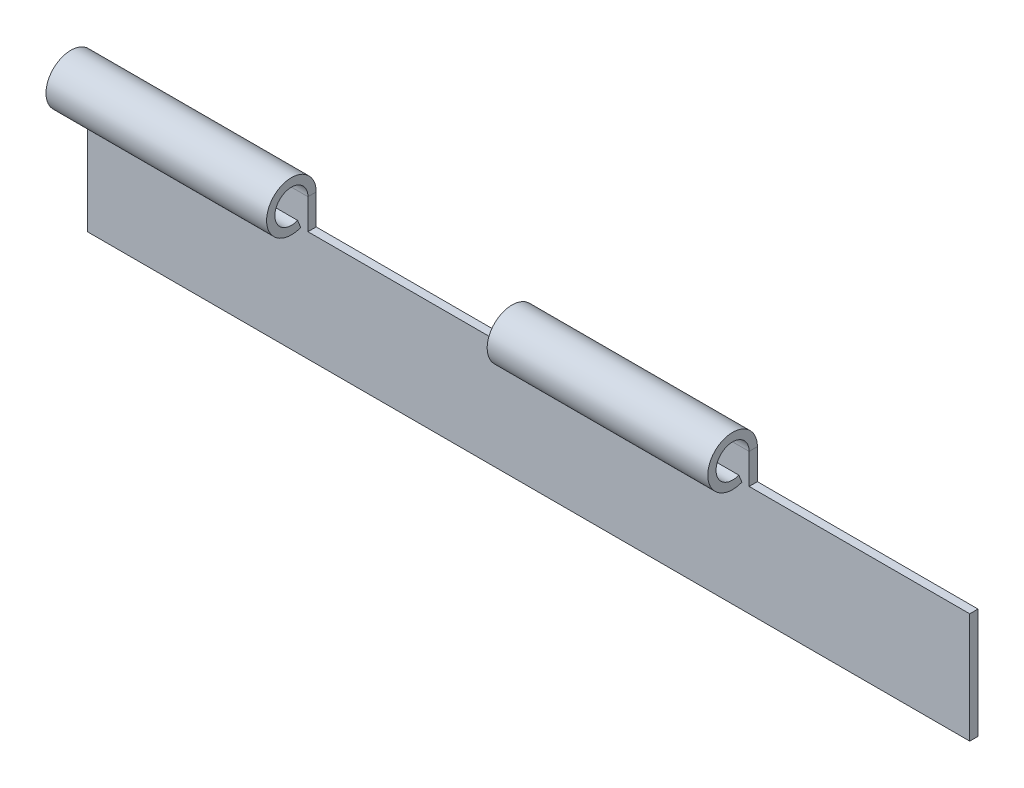
ISO-10303-21;
HEADER;
FILE_DESCRIPTION(('STEP AP214'),'2;1');
FILE_NAME('part.step','',(''),(''),'','','');
FILE_SCHEMA(('AUTOMOTIVE_DESIGN { 1 0 10303 214 1 1 1 1 }'));
ENDSEC;
DATA;
#1=APPLICATION_CONTEXT('core data for automotive mechanical design processes');
#2=APPLICATION_PROTOCOL_DEFINITION('international standard','automotive_design',2000,#1);
#3=PRODUCT_CONTEXT('',#1,'mechanical');
#4=PRODUCT('Part','Part','',(#3));
#5=PRODUCT_RELATED_PRODUCT_CATEGORY('part','',(#4));
#6=PRODUCT_DEFINITION_FORMATION('','',#4);
#7=PRODUCT_DEFINITION_CONTEXT('part definition',#1,'design');
#8=PRODUCT_DEFINITION('design','',#6,#7);
#9=PRODUCT_DEFINITION_SHAPE('','',#8);
#10=(LENGTH_UNIT() NAMED_UNIT(*) SI_UNIT(.MILLI.,.METRE.));
#11=(NAMED_UNIT(*) PLANE_ANGLE_UNIT() SI_UNIT($,.RADIAN.));
#12=(NAMED_UNIT(*) SI_UNIT($,.STERADIAN.) SOLID_ANGLE_UNIT());
#13=UNCERTAINTY_MEASURE_WITH_UNIT(LENGTH_MEASURE(1.E-05),#10,'distance_accuracy_value','');
#14=(GEOMETRIC_REPRESENTATION_CONTEXT(3) GLOBAL_UNCERTAINTY_ASSIGNED_CONTEXT((#13)) GLOBAL_UNIT_ASSIGNED_CONTEXT((#10,
#11,#12)) REPRESENTATION_CONTEXT('',''));
#15=CARTESIAN_POINT('',(0.,0.,0.));
#16=DIRECTION('',(0.,0.,1.));
#17=DIRECTION('',(1.,0.,0.));
#18=AXIS2_PLACEMENT_3D('',#15,#16,#17);
#19=CARTESIAN_POINT('',(80.,20.,-1.5));
#20=DIRECTION('',(-1.,0.,0.));
#21=DIRECTION('',(0.,0.,1.));
#22=AXIS2_PLACEMENT_3D('',#19,#20,#21);
#23=PLANE('',#22);
#24=DIRECTION('',(0.,-1.,0.));
#25=VECTOR('',#24,1.);
#26=CARTESIAN_POINT('',(80.,20.,0.));
#27=LINE('',#26,#25);
#28=CARTESIAN_POINT('',(80.,25.5,0.));
#29=VERTEX_POINT('',#28);
#30=CARTESIAN_POINT('',(80.,20.,0.));
#31=VERTEX_POINT('',#30);
#32=EDGE_CURVE('E250',#29,#31,#27,.T.);
#33=ORIENTED_EDGE('',*,*,#32,.F.);
#34=DIRECTION('',(0.,0.,-1.));
#35=VECTOR('',#34,1.);
#36=CARTESIAN_POINT('',(80.,25.5,0.));
#37=LINE('',#36,#35);
#38=CARTESIAN_POINT('',(80.,25.5,-1.5));
#39=VERTEX_POINT('',#38);
#40=EDGE_CURVE('E159',#29,#39,#37,.T.);
#41=ORIENTED_EDGE('',*,*,#40,.T.);
#42=DIRECTION('',(0.,-1.,0.));
#43=VECTOR('',#42,1.);
#44=CARTESIAN_POINT('',(80.,20.,-1.5));
#45=LINE('',#44,#43);
#46=CARTESIAN_POINT('',(80.,20.,-1.5));
#47=VERTEX_POINT('',#46);
#48=EDGE_CURVE('E169',#39,#47,#45,.T.);
#49=ORIENTED_EDGE('',*,*,#48,.T.);
#50=DIRECTION('',(0.,0.,1.));
#51=VECTOR('',#50,1.);
#52=CARTESIAN_POINT('',(80.,20.,-1.5));
#53=LINE('',#52,#51);
#54=EDGE_CURVE('E262',#47,#31,#53,.T.);
#55=ORIENTED_EDGE('',*,*,#54,.T.);
#56=EDGE_LOOP('',(#33,#41,#49,#55));
#57=FACE_BOUND('',#56,.T.);
#58=ADVANCED_FACE('F43',(#57),#23,.T.);
#59=CARTESIAN_POINT('',(0.,0.,-1.5));
#60=DIRECTION('',(-1.,0.,0.));
#61=DIRECTION('',(0.,0.,1.));
#62=AXIS2_PLACEMENT_3D('',#59,#60,#61);
#63=PLANE('',#62);
#64=DIRECTION('',(0.,-1.,0.));
#65=VECTOR('',#64,1.);
#66=CARTESIAN_POINT('',(0.,0.,0.));
#67=LINE('',#66,#65);
#68=CARTESIAN_POINT('',(0.,25.5,0.));
#69=VERTEX_POINT('',#68);
#70=CARTESIAN_POINT('',(0.,0.,0.));
#71=VERTEX_POINT('',#70);
#72=EDGE_CURVE('E229',#69,#71,#67,.T.);
#73=ORIENTED_EDGE('',*,*,#72,.F.);
#74=DIRECTION('',(0.,0.,-1.));
#75=VECTOR('',#74,1.);
#76=CARTESIAN_POINT('',(0.,25.5,0.));
#77=LINE('',#76,#75);
#78=CARTESIAN_POINT('',(0.,25.5,-1.5));
#79=VERTEX_POINT('',#78);
#80=EDGE_CURVE('E202',#69,#79,#77,.T.);
#81=ORIENTED_EDGE('',*,*,#80,.T.);
#82=DIRECTION('',(0.,-1.,0.));
#83=VECTOR('',#82,1.);
#84=CARTESIAN_POINT('',(0.,0.,-1.5));
#85=LINE('',#84,#83);
#86=CARTESIAN_POINT('',(0.,0.,-1.5));
#87=VERTEX_POINT('',#86);
#88=EDGE_CURVE('E238',#79,#87,#85,.T.);
#89=ORIENTED_EDGE('',*,*,#88,.T.);
#90=DIRECTION('',(0.,0.,1.));
#91=VECTOR('',#90,1.);
#92=CARTESIAN_POINT('',(0.,0.,-1.5));
#93=LINE('',#92,#91);
#94=EDGE_CURVE('E11',#87,#71,#93,.T.);
#95=ORIENTED_EDGE('',*,*,#94,.T.);
#96=EDGE_LOOP('',(#73,#81,#89,#95));
#97=FACE_BOUND('',#96,.T.);
#98=ADVANCED_FACE('F279',(#97),#63,.T.);
#99=CARTESIAN_POINT('',(160.,0.,-1.5));
#100=DIRECTION('',(0.,-1.,0.));
#101=DIRECTION('',(1.,0.,0.));
#102=AXIS2_PLACEMENT_3D('',#99,#100,#101);
#103=PLANE('',#102);
#104=DIRECTION('',(1.,0.,0.));
#105=VECTOR('',#104,1.);
#106=CARTESIAN_POINT('',(160.,0.,0.));
#107=LINE('',#106,#105);
#108=CARTESIAN_POINT('',(160.,0.,0.));
#109=VERTEX_POINT('',#108);
#110=EDGE_CURVE('E222',#71,#109,#107,.T.);
#111=ORIENTED_EDGE('',*,*,#110,.F.);
#112=ORIENTED_EDGE('',*,*,#94,.F.);
#113=DIRECTION('',(1.,0.,0.));
#114=VECTOR('',#113,1.);
#115=CARTESIAN_POINT('',(160.,0.,-1.5));
#116=LINE('',#115,#114);
#117=CARTESIAN_POINT('',(160.,0.,-1.5));
#118=VERTEX_POINT('',#117);
#119=EDGE_CURVE('E225',#87,#118,#116,.T.);
#120=ORIENTED_EDGE('',*,*,#119,.T.);
#121=DIRECTION('',(0.,0.,1.));
#122=VECTOR('',#121,1.);
#123=CARTESIAN_POINT('',(160.,0.,-1.5));
#124=LINE('',#123,#122);
#125=EDGE_CURVE('E47',#118,#109,#124,.T.);
#126=ORIENTED_EDGE('',*,*,#125,.T.);
#127=EDGE_LOOP('',(#111,#112,#120,#126));
#128=FACE_BOUND('',#127,.T.);
#129=ADVANCED_FACE('F45',(#128),#103,.T.);
#130=CARTESIAN_POINT('',(40.,30.,-1.5));
#131=DIRECTION('',(1.,0.,0.));
#132=DIRECTION('',(0.,0.,-1.));
#133=AXIS2_PLACEMENT_3D('',#130,#131,#132);
#134=PLANE('',#133);
#135=DIRECTION('',(0.,0.,-1.));
#136=VECTOR('',#135,1.);
#137=CARTESIAN_POINT('',(40.,25.5,0.));
#138=LINE('',#137,#136);
#139=CARTESIAN_POINT('',(40.,25.5,0.));
#140=VERTEX_POINT('',#139);
#141=CARTESIAN_POINT('',(40.,25.5,-1.5));
#142=VERTEX_POINT('',#141);
#143=EDGE_CURVE('E213',#140,#142,#138,.T.);
#144=ORIENTED_EDGE('',*,*,#143,.F.);
#145=DIRECTION('',(0.,1.,0.));
#146=VECTOR('',#145,1.);
#147=CARTESIAN_POINT('',(40.,30.,0.));
#148=LINE('',#147,#146);
#149=CARTESIAN_POINT('',(40.,20.,0.));
#150=VERTEX_POINT('',#149);
#151=EDGE_CURVE('E255',#150,#140,#148,.T.);
#152=ORIENTED_EDGE('',*,*,#151,.F.);
#153=DIRECTION('',(0.,0.,1.));
#154=VECTOR('',#153,1.);
#155=CARTESIAN_POINT('',(40.,20.,-1.5));
#156=LINE('',#155,#154);
#157=CARTESIAN_POINT('',(40.,20.,-1.5));
#158=VERTEX_POINT('',#157);
#159=EDGE_CURVE('E52',#158,#150,#156,.T.);
#160=ORIENTED_EDGE('',*,*,#159,.F.);
#161=DIRECTION('',(0.,1.,0.));
#162=VECTOR('',#161,1.);
#163=CARTESIAN_POINT('',(40.,30.,-1.5));
#164=LINE('',#163,#162);
#165=EDGE_CURVE('E235',#158,#142,#164,.T.);
#166=ORIENTED_EDGE('',*,*,#165,.T.);
#167=EDGE_LOOP('',(#144,#152,#160,#166));
#168=FACE_BOUND('',#167,.T.);
#169=ADVANCED_FACE('F309',(#168),#134,.T.);
#170=CARTESIAN_POINT('',(40.,20.,-1.5));
#171=DIRECTION('',(0.,1.,0.));
#172=DIRECTION('',(-1.,0.,0.));
#173=AXIS2_PLACEMENT_3D('',#170,#171,#172);
#174=PLANE('',#173);
#175=DIRECTION('',(-1.,0.,0.));
#176=VECTOR('',#175,1.);
#177=CARTESIAN_POINT('',(40.,20.,0.));
#178=LINE('',#177,#176);
#179=EDGE_CURVE('E253',#31,#150,#178,.T.);
#180=ORIENTED_EDGE('',*,*,#179,.F.);
#181=ORIENTED_EDGE('',*,*,#54,.F.);
#182=DIRECTION('',(-1.,0.,0.));
#183=VECTOR('',#182,1.);
#184=CARTESIAN_POINT('',(40.,20.,-1.5));
#185=LINE('',#184,#183);
#186=EDGE_CURVE('E233',#47,#158,#185,.T.);
#187=ORIENTED_EDGE('',*,*,#186,.T.);
#188=ORIENTED_EDGE('',*,*,#159,.T.);
#189=EDGE_LOOP('',(#180,#181,#187,#188));
#190=FACE_BOUND('',#189,.T.);
#191=ADVANCED_FACE('F303',(#190),#174,.T.);
#192=CARTESIAN_POINT('',(120.,30.,-1.5));
#193=DIRECTION('',(1.,0.,0.));
#194=DIRECTION('',(0.,0.,-1.));
#195=AXIS2_PLACEMENT_3D('',#192,#193,#194);
#196=PLANE('',#195);
#197=DIRECTION('',(0.,0.,-1.));
#198=VECTOR('',#197,1.);
#199=CARTESIAN_POINT('',(120.,25.5,0.));
#200=LINE('',#199,#198);
#201=CARTESIAN_POINT('',(120.,25.5,0.));
#202=VERTEX_POINT('',#201);
#203=CARTESIAN_POINT('',(120.,25.5,-1.5));
#204=VERTEX_POINT('',#203);
#205=EDGE_CURVE('E177',#202,#204,#200,.T.);
#206=ORIENTED_EDGE('',*,*,#205,.F.);
#207=DIRECTION('',(0.,1.,0.));
#208=VECTOR('',#207,1.);
#209=CARTESIAN_POINT('',(120.,30.,0.));
#210=LINE('',#209,#208);
#211=CARTESIAN_POINT('',(120.,20.,0.));
#212=VERTEX_POINT('',#211);
#213=EDGE_CURVE('E247',#212,#202,#210,.T.);
#214=ORIENTED_EDGE('',*,*,#213,.F.);
#215=DIRECTION('',(0.,0.,1.));
#216=VECTOR('',#215,1.);
#217=CARTESIAN_POINT('',(120.,20.,-1.5));
#218=LINE('',#217,#216);
#219=CARTESIAN_POINT('',(120.,20.,-1.5));
#220=VERTEX_POINT('',#219);
#221=EDGE_CURVE('E179',#220,#212,#218,.T.);
#222=ORIENTED_EDGE('',*,*,#221,.F.);
#223=DIRECTION('',(0.,1.,0.));
#224=VECTOR('',#223,1.);
#225=CARTESIAN_POINT('',(120.,30.,-1.5));
#226=LINE('',#225,#224);
#227=EDGE_CURVE('E166',#220,#204,#226,.T.);
#228=ORIENTED_EDGE('',*,*,#227,.T.);
#229=EDGE_LOOP('',(#206,#214,#222,#228));
#230=FACE_BOUND('',#229,.T.);
#231=ADVANCED_FACE('F175',(#230),#196,.T.);
#232=CARTESIAN_POINT('',(120.,20.,-1.5));
#233=DIRECTION('',(0.,1.,0.));
#234=DIRECTION('',(0.,0.,1.));
#235=AXIS2_PLACEMENT_3D('',#232,#233,#234);
#236=PLANE('',#235);
#237=DIRECTION('',(-1.,0.,0.));
#238=VECTOR('',#237,1.);
#239=CARTESIAN_POINT('',(120.,20.,0.));
#240=LINE('',#239,#238);
#241=CARTESIAN_POINT('',(160.,20.,0.));
#242=VERTEX_POINT('',#241);
#243=EDGE_CURVE('E245',#242,#212,#240,.T.);
#244=ORIENTED_EDGE('',*,*,#243,.F.);
#245=DIRECTION('',(0.,0.,1.));
#246=VECTOR('',#245,1.);
#247=CARTESIAN_POINT('',(160.,20.,-1.5));
#248=LINE('',#247,#246);
#249=CARTESIAN_POINT('',(160.,20.,-1.5));
#250=VERTEX_POINT('',#249);
#251=EDGE_CURVE('E265',#250,#242,#248,.T.);
#252=ORIENTED_EDGE('',*,*,#251,.F.);
#253=DIRECTION('',(-1.,0.,0.));
#254=VECTOR('',#253,1.);
#255=CARTESIAN_POINT('',(120.,20.,-1.5));
#256=LINE('',#255,#254);
#257=EDGE_CURVE('E180',#250,#220,#256,.T.);
#258=ORIENTED_EDGE('',*,*,#257,.T.);
#259=ORIENTED_EDGE('',*,*,#221,.T.);
#260=EDGE_LOOP('',(#244,#252,#258,#259));
#261=FACE_BOUND('',#260,.T.);
#262=ADVANCED_FACE('F285',(#261),#236,.T.);
#263=CARTESIAN_POINT('',(160.,20.,-1.5));
#264=DIRECTION('',(1.,0.,0.));
#265=DIRECTION('',(0.,0.,-1.));
#266=AXIS2_PLACEMENT_3D('',#263,#264,#265);
#267=PLANE('',#266);
#268=DIRECTION('',(0.,1.,0.));
#269=VECTOR('',#268,1.);
#270=CARTESIAN_POINT('',(160.,20.,0.));
#271=LINE('',#270,#269);
#272=EDGE_CURVE('E243',#109,#242,#271,.T.);
#273=ORIENTED_EDGE('',*,*,#272,.F.);
#274=ORIENTED_EDGE('',*,*,#125,.F.);
#275=DIRECTION('',(0.,1.,0.));
#276=VECTOR('',#275,1.);
#277=CARTESIAN_POINT('',(160.,20.,-1.5));
#278=LINE('',#277,#276);
#279=EDGE_CURVE('E228',#118,#250,#278,.T.);
#280=ORIENTED_EDGE('',*,*,#279,.T.);
#281=ORIENTED_EDGE('',*,*,#251,.T.);
#282=EDGE_LOOP('',(#273,#274,#280,#281));
#283=FACE_BOUND('',#282,.T.);
#284=ADVANCED_FACE('F283',(#283),#267,.T.);
#285=CARTESIAN_POINT('',(0.,0.,-1.5));
#286=DIRECTION('',(0.,0.,-1.));
#287=DIRECTION('',(-1.,0.,0.));
#288=AXIS2_PLACEMENT_3D('',#285,#286,#287);
#289=PLANE('',#288);
#290=DIRECTION('',(-1.,0.,0.));
#291=VECTOR('',#290,1.);
#292=CARTESIAN_POINT('',(80.,25.5,-1.5));
#293=LINE('',#292,#291);
#294=EDGE_CURVE('E151',#39,#204,#293,.F.);
#295=ORIENTED_EDGE('',*,*,#294,.T.);
#296=ORIENTED_EDGE('',*,*,#227,.F.);
#297=ORIENTED_EDGE('',*,*,#257,.F.);
#298=ORIENTED_EDGE('',*,*,#279,.F.);
#299=ORIENTED_EDGE('',*,*,#119,.F.);
#300=ORIENTED_EDGE('',*,*,#88,.F.);
#301=DIRECTION('',(-1.,0.,0.));
#302=VECTOR('',#301,1.);
#303=CARTESIAN_POINT('',(0.,25.5,-1.5));
#304=LINE('',#303,#302);
#305=EDGE_CURVE('E196',#79,#142,#304,.F.);
#306=ORIENTED_EDGE('',*,*,#305,.T.);
#307=ORIENTED_EDGE('',*,*,#165,.F.);
#308=ORIENTED_EDGE('',*,*,#186,.F.);
#309=ORIENTED_EDGE('',*,*,#48,.F.);
#310=EDGE_LOOP('',(#295,#296,#297,#298,#299,#300,#306,#307,#308,#309));
#311=FACE_BOUND('',#310,.T.);
#312=ADVANCED_FACE('F164',(#311),#289,.T.);
#313=CARTESIAN_POINT('',(0.,0.,0.));
#314=DIRECTION('',(0.,0.,-1.));
#315=DIRECTION('',(-1.,0.,0.));
#316=AXIS2_PLACEMENT_3D('',#313,#314,#315);
#317=PLANE('',#316);
#318=ORIENTED_EDGE('',*,*,#213,.T.);
#319=DIRECTION('',(-1.,0.,0.));
#320=VECTOR('',#319,1.);
#321=CARTESIAN_POINT('',(80.,25.5,0.));
#322=LINE('',#321,#320);
#323=EDGE_CURVE('E318',#29,#202,#322,.F.);
#324=ORIENTED_EDGE('',*,*,#323,.F.);
#325=ORIENTED_EDGE('',*,*,#32,.T.);
#326=ORIENTED_EDGE('',*,*,#179,.T.);
#327=ORIENTED_EDGE('',*,*,#151,.T.);
#328=DIRECTION('',(-1.,0.,0.));
#329=VECTOR('',#328,1.);
#330=CARTESIAN_POINT('',(0.,25.5,0.));
#331=LINE('',#330,#329);
#332=EDGE_CURVE('E209',#69,#140,#331,.F.);
#333=ORIENTED_EDGE('',*,*,#332,.F.);
#334=ORIENTED_EDGE('',*,*,#72,.T.);
#335=ORIENTED_EDGE('',*,*,#110,.T.);
#336=ORIENTED_EDGE('',*,*,#272,.T.);
#337=ORIENTED_EDGE('',*,*,#243,.T.);
#338=EDGE_LOOP('',(#318,#324,#325,#326,#327,#333,#334,#335,#336,#337));
#339=FACE_BOUND('',#338,.T.);
#340=ADVANCED_FACE('F275',(#339),#317,.F.);
#341=CARTESIAN_POINT('',(20.,22.7184484362996,1.87618021975223));
#342=DIRECTION('',(0.,-0.374606593415923,0.927183854566783));
#343=DIRECTION('',(-1.,0.,0.));
#344=AXIS2_PLACEMENT_3D('',#341,#342,#343);
#345=PLANE('',#344);
#346=DIRECTION('',(0.,-0.927183854566783,-0.374606593415923));
#347=VECTOR('',#346,1.);
#348=CARTESIAN_POINT('',(0.,22.7184484362996,1.87618021975223));
#349=LINE('',#348,#347);
#350=CARTESIAN_POINT('',(0.,22.7184484362996,1.87618021975223));
#351=VERTEX_POINT('',#350);
#352=CARTESIAN_POINT('',(0.,21.3276726544495,1.31427032962835));
#353=VERTEX_POINT('',#352);
#354=EDGE_CURVE('E219',#351,#353,#349,.T.);
#355=ORIENTED_EDGE('',*,*,#354,.F.);
#356=DIRECTION('',(-1.,0.,0.));
#357=VECTOR('',#356,1.);
#358=CARTESIAN_POINT('',(0.,22.7184484362996,1.87618021975223));
#359=LINE('',#358,#357);
#360=CARTESIAN_POINT('',(40.,22.7184484362996,1.87618021975223));
#361=VERTEX_POINT('',#360);
#362=EDGE_CURVE('E194',#361,#351,#359,.T.);
#363=ORIENTED_EDGE('',*,*,#362,.F.);
#364=DIRECTION('',(0.,-0.927183854566783,-0.374606593415923));
#365=VECTOR('',#364,1.);
#366=CARTESIAN_POINT('',(40.,22.7184484362996,1.87618021975223));
#367=LINE('',#366,#365);
#368=CARTESIAN_POINT('',(40.,21.3276726544495,1.31427032962835));
#369=VERTEX_POINT('',#368);
#370=EDGE_CURVE('E216',#361,#369,#367,.T.);
#371=ORIENTED_EDGE('',*,*,#370,.T.);
#372=DIRECTION('',(-1.,0.,0.));
#373=VECTOR('',#372,1.);
#374=CARTESIAN_POINT('',(0.,21.3276726544495,1.31427032962835));
#375=LINE('',#374,#373);
#376=EDGE_CURVE('E203',#369,#353,#375,.T.);
#377=ORIENTED_EDGE('',*,*,#376,.T.);
#378=EDGE_LOOP('',(#355,#363,#371,#377));
#379=FACE_BOUND('',#378,.T.);
#380=ADVANCED_FACE('F352',(#379),#345,.F.);
#381=CARTESIAN_POINT('',(40.,25.5,3.));
#382=DIRECTION('',(1.,0.,0.));
#383=DIRECTION('',(0.,0.,-1.));
#384=AXIS2_PLACEMENT_3D('',#381,#382,#383);
#385=PLANE('',#384);
#386=ORIENTED_EDGE('',*,*,#370,.F.);
#387=CARTESIAN_POINT('',(40.,25.5,3.));
#388=DIRECTION('',(-1.,0.,0.));
#389=DIRECTION('',(0.,0.,1.));
#390=AXIS2_PLACEMENT_3D('',#387,#388,#389);
#391=CIRCLE('',#390,3.);
#392=EDGE_CURVE('E206',#140,#361,#391,.F.);
#393=ORIENTED_EDGE('',*,*,#392,.F.);
#394=ORIENTED_EDGE('',*,*,#143,.T.);
#395=CARTESIAN_POINT('',(40.,25.5,3.));
#396=DIRECTION('',(-1.,0.,0.));
#397=DIRECTION('',(0.,0.,1.));
#398=AXIS2_PLACEMENT_3D('',#395,#396,#397);
#399=CIRCLE('',#398,4.5);
#400=EDGE_CURVE('E199',#142,#369,#399,.F.);
#401=ORIENTED_EDGE('',*,*,#400,.T.);
#402=EDGE_LOOP('',(#386,#393,#394,#401));
#403=FACE_BOUND('',#402,.T.);
#404=ADVANCED_FACE('F349',(#403),#385,.T.);
#405=CARTESIAN_POINT('',(0.,25.5,3.));
#406=DIRECTION('',(1.,0.,0.));
#407=DIRECTION('',(0.,0.,-1.));
#408=AXIS2_PLACEMENT_3D('',#405,#406,#407);
#409=PLANE('',#408);
#410=CARTESIAN_POINT('',(0.,25.5,3.));
#411=DIRECTION('',(-1.,0.,0.));
#412=DIRECTION('',(0.,0.,1.));
#413=AXIS2_PLACEMENT_3D('',#410,#411,#412);
#414=CIRCLE('',#413,3.);
#415=EDGE_CURVE('E68',#351,#69,#414,.T.);
#416=ORIENTED_EDGE('',*,*,#415,.F.);
#417=ORIENTED_EDGE('',*,*,#354,.T.);
#418=CARTESIAN_POINT('',(0.,25.5,3.));
#419=DIRECTION('',(-1.,0.,0.));
#420=DIRECTION('',(0.,0.,1.));
#421=AXIS2_PLACEMENT_3D('',#418,#419,#420);
#422=CIRCLE('',#421,4.5);
#423=EDGE_CURVE('E200',#353,#79,#422,.T.);
#424=ORIENTED_EDGE('',*,*,#423,.T.);
#425=ORIENTED_EDGE('',*,*,#80,.F.);
#426=EDGE_LOOP('',(#416,#417,#424,#425));
#427=FACE_BOUND('',#426,.T.);
#428=ADVANCED_FACE('F346',(#427),#409,.F.);
#429=CARTESIAN_POINT('',(0.,25.5,3.));
#430=DIRECTION('',(-1.,0.,0.));
#431=DIRECTION('',(0.,-0.927183854566783,-0.374606593415923));
#432=AXIS2_PLACEMENT_3D('',#429,#430,#431);
#433=CYLINDRICAL_SURFACE('',#432,4.5);
#434=ORIENTED_EDGE('',*,*,#305,.F.);
#435=ORIENTED_EDGE('',*,*,#423,.F.);
#436=ORIENTED_EDGE('',*,*,#376,.F.);
#437=ORIENTED_EDGE('',*,*,#400,.F.);
#438=EDGE_LOOP('',(#434,#435,#436,#437));
#439=FACE_BOUND('',#438,.T.);
#440=ADVANCED_FACE('F339',(#439),#433,.T.);
#441=CARTESIAN_POINT('',(0.,25.5,3.));
#442=DIRECTION('',(-1.,0.,0.));
#443=DIRECTION('',(0.,-0.927183854566783,-0.374606593415923));
#444=AXIS2_PLACEMENT_3D('',#441,#442,#443);
#445=CYLINDRICAL_SURFACE('',#444,3.);
#446=ORIENTED_EDGE('',*,*,#332,.T.);
#447=ORIENTED_EDGE('',*,*,#392,.T.);
#448=ORIENTED_EDGE('',*,*,#362,.T.);
#449=ORIENTED_EDGE('',*,*,#415,.T.);
#450=EDGE_LOOP('',(#446,#447,#448,#449));
#451=FACE_BOUND('',#450,.T.);
#452=ADVANCED_FACE('F332',(#451),#445,.F.);
#453=CARTESIAN_POINT('',(100.,22.7184484362996,1.87618021975223));
#454=DIRECTION('',(0.,-0.374606593415923,0.927183854566783));
#455=DIRECTION('',(-1.,0.,0.));
#456=AXIS2_PLACEMENT_3D('',#453,#454,#455);
#457=PLANE('',#456);
#458=DIRECTION('',(0.,-0.927183854566783,-0.374606593415923));
#459=VECTOR('',#458,1.);
#460=CARTESIAN_POINT('',(80.,22.7184484362996,1.87618021975223));
#461=LINE('',#460,#459);
#462=CARTESIAN_POINT('',(80.,22.7184484362996,1.87618021975223));
#463=VERTEX_POINT('',#462);
#464=CARTESIAN_POINT('',(80.,21.3276726544495,1.31427032962835));
#465=VERTEX_POINT('',#464);
#466=EDGE_CURVE('E186',#463,#465,#461,.T.);
#467=ORIENTED_EDGE('',*,*,#466,.F.);
#468=DIRECTION('',(-1.,0.,0.));
#469=VECTOR('',#468,1.);
#470=CARTESIAN_POINT('',(80.,22.7184484362996,1.87618021975223));
#471=LINE('',#470,#469);
#472=CARTESIAN_POINT('',(120.,22.7184484362996,1.87618021975223));
#473=VERTEX_POINT('',#472);
#474=EDGE_CURVE('E190',#473,#463,#471,.T.);
#475=ORIENTED_EDGE('',*,*,#474,.F.);
#476=DIRECTION('',(0.,-0.927183854566783,-0.374606593415923));
#477=VECTOR('',#476,1.);
#478=CARTESIAN_POINT('',(120.,22.7184484362996,1.87618021975223));
#479=LINE('',#478,#477);
#480=CARTESIAN_POINT('',(120.,21.3276726544495,1.31427032962835));
#481=VERTEX_POINT('',#480);
#482=EDGE_CURVE('E184',#473,#481,#479,.T.);
#483=ORIENTED_EDGE('',*,*,#482,.T.);
#484=DIRECTION('',(-1.,0.,0.));
#485=VECTOR('',#484,1.);
#486=CARTESIAN_POINT('',(80.,21.3276726544495,1.31427032962835));
#487=LINE('',#486,#485);
#488=EDGE_CURVE('E154',#481,#465,#487,.T.);
#489=ORIENTED_EDGE('',*,*,#488,.T.);
#490=EDGE_LOOP('',(#467,#475,#483,#489));
#491=FACE_BOUND('',#490,.T.);
#492=ADVANCED_FACE('F330',(#491),#457,.F.);
#493=CARTESIAN_POINT('',(120.,25.5,3.));
#494=DIRECTION('',(1.,0.,0.));
#495=DIRECTION('',(0.,0.,-1.));
#496=AXIS2_PLACEMENT_3D('',#493,#494,#495);
#497=PLANE('',#496);
#498=ORIENTED_EDGE('',*,*,#482,.F.);
#499=CARTESIAN_POINT('',(120.,25.5,3.));
#500=DIRECTION('',(-1.,0.,0.));
#501=DIRECTION('',(0.,0.,1.));
#502=AXIS2_PLACEMENT_3D('',#499,#500,#501);
#503=CIRCLE('',#502,3.);
#504=EDGE_CURVE('E183',#202,#473,#503,.F.);
#505=ORIENTED_EDGE('',*,*,#504,.F.);
#506=ORIENTED_EDGE('',*,*,#205,.T.);
#507=CARTESIAN_POINT('',(120.,25.5,3.));
#508=DIRECTION('',(-1.,0.,0.));
#509=DIRECTION('',(0.,0.,1.));
#510=AXIS2_PLACEMENT_3D('',#507,#508,#509);
#511=CIRCLE('',#510,4.5);
#512=EDGE_CURVE('E148',#204,#481,#511,.F.);
#513=ORIENTED_EDGE('',*,*,#512,.T.);
#514=EDGE_LOOP('',(#498,#505,#506,#513));
#515=FACE_BOUND('',#514,.T.);
#516=ADVANCED_FACE('F182',(#515),#497,.T.);
#517=CARTESIAN_POINT('',(80.,25.5,3.));
#518=DIRECTION('',(1.,0.,0.));
#519=DIRECTION('',(0.,0.,-1.));
#520=AXIS2_PLACEMENT_3D('',#517,#518,#519);
#521=PLANE('',#520);
#522=CARTESIAN_POINT('',(80.,25.5,3.));
#523=DIRECTION('',(-1.,0.,0.));
#524=DIRECTION('',(0.,0.,1.));
#525=AXIS2_PLACEMENT_3D('',#522,#523,#524);
#526=CIRCLE('',#525,3.);
#527=EDGE_CURVE('E60',#463,#29,#526,.T.);
#528=ORIENTED_EDGE('',*,*,#527,.F.);
#529=ORIENTED_EDGE('',*,*,#466,.T.);
#530=CARTESIAN_POINT('',(80.,25.5,3.));
#531=DIRECTION('',(-1.,0.,0.));
#532=DIRECTION('',(0.,0.,1.));
#533=AXIS2_PLACEMENT_3D('',#530,#531,#532);
#534=CIRCLE('',#533,4.5);
#535=EDGE_CURVE('E171',#465,#39,#534,.T.);
#536=ORIENTED_EDGE('',*,*,#535,.T.);
#537=ORIENTED_EDGE('',*,*,#40,.F.);
#538=EDGE_LOOP('',(#528,#529,#536,#537));
#539=FACE_BOUND('',#538,.T.);
#540=ADVANCED_FACE('F322',(#539),#521,.F.);
#541=CARTESIAN_POINT('',(80.,25.5,3.));
#542=DIRECTION('',(-1.,0.,0.));
#543=DIRECTION('',(0.,-0.927183854566783,-0.374606593415923));
#544=AXIS2_PLACEMENT_3D('',#541,#542,#543);
#545=CYLINDRICAL_SURFACE('',#544,4.5);
#546=ORIENTED_EDGE('',*,*,#294,.F.);
#547=ORIENTED_EDGE('',*,*,#535,.F.);
#548=ORIENTED_EDGE('',*,*,#488,.F.);
#549=ORIENTED_EDGE('',*,*,#512,.F.);
#550=EDGE_LOOP('',(#546,#547,#548,#549));
#551=FACE_BOUND('',#550,.T.);
#552=ADVANCED_FACE('F150',(#551),#545,.T.);
#553=CARTESIAN_POINT('',(80.,25.5,3.));
#554=DIRECTION('',(-1.,0.,0.));
#555=DIRECTION('',(0.,-0.927183854566783,-0.374606593415923));
#556=AXIS2_PLACEMENT_3D('',#553,#554,#555);
#557=CYLINDRICAL_SURFACE('',#556,3.);
#558=ORIENTED_EDGE('',*,*,#323,.T.);
#559=ORIENTED_EDGE('',*,*,#504,.T.);
#560=ORIENTED_EDGE('',*,*,#474,.T.);
#561=ORIENTED_EDGE('',*,*,#527,.T.);
#562=EDGE_LOOP('',(#558,#559,#560,#561));
#563=FACE_BOUND('',#562,.T.);
#564=ADVANCED_FACE('F328',(#563),#557,.F.);
#565=CLOSED_SHELL('',(#58,#98,#129,#169,#191,#231,#262,#284,#312,#340,#380,#404,#428,#440,#452,
#492,#516,#540,#552,#564));
#566=MANIFOLD_SOLID_BREP('B2',#565);
#567=ADVANCED_BREP_SHAPE_REPRESENTATION('',(#18,#566),#14);
#568=SHAPE_DEFINITION_REPRESENTATION(#9,#567);
ENDSEC;
END-ISO-10303-21;
